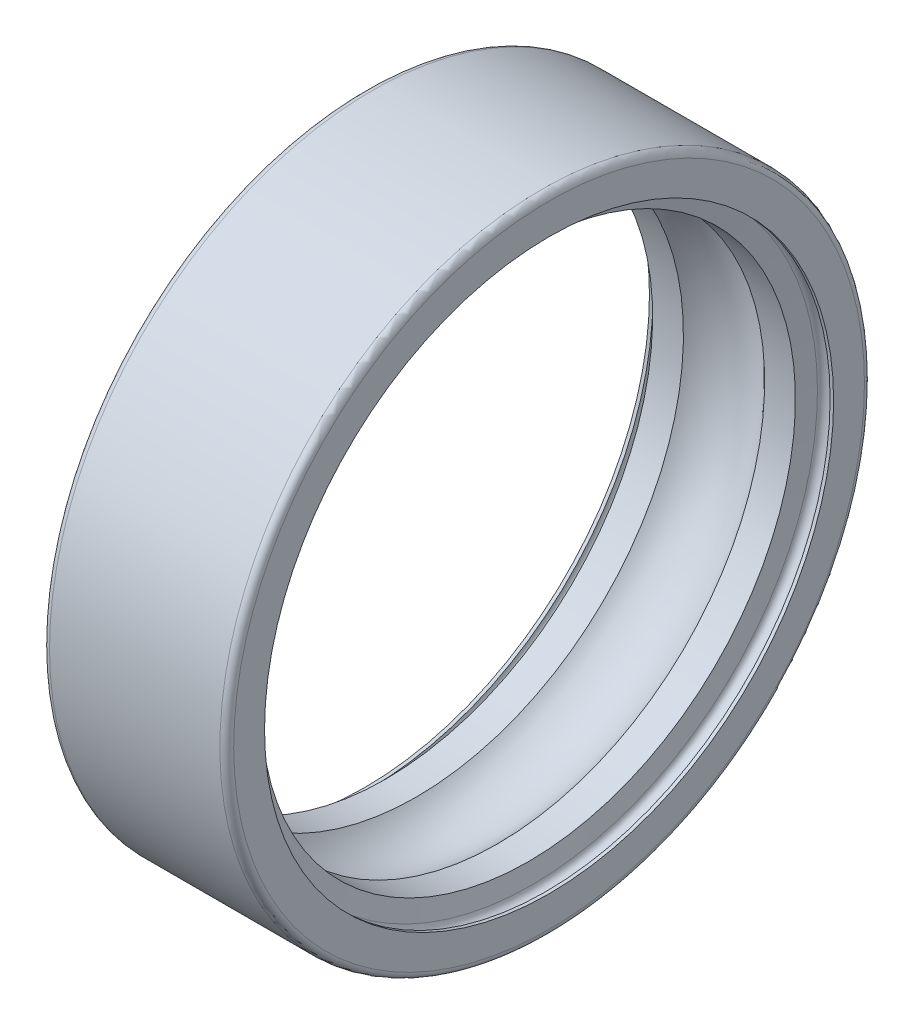
ISO-10303-21;
HEADER;
FILE_DESCRIPTION(('STEP AP214'),'2;1');
FILE_NAME('part.step','',(''),(''),'','','');
FILE_SCHEMA(('AUTOMOTIVE_DESIGN { 1 0 10303 214 1 1 1 1 }'));
ENDSEC;
DATA;
#1=APPLICATION_CONTEXT('core data for automotive mechanical design processes');
#2=APPLICATION_PROTOCOL_DEFINITION('international standard','automotive_design',2000,#1);
#3=PRODUCT_CONTEXT('',#1,'mechanical');
#4=PRODUCT('Part','Part','',(#3));
#5=PRODUCT_RELATED_PRODUCT_CATEGORY('part','',(#4));
#6=PRODUCT_DEFINITION_FORMATION('','',#4);
#7=PRODUCT_DEFINITION_CONTEXT('part definition',#1,'design');
#8=PRODUCT_DEFINITION('design','',#6,#7);
#9=PRODUCT_DEFINITION_SHAPE('','',#8);
#10=(LENGTH_UNIT() NAMED_UNIT(*) SI_UNIT(.MILLI.,.METRE.));
#11=(NAMED_UNIT(*) PLANE_ANGLE_UNIT() SI_UNIT($,.RADIAN.));
#12=(NAMED_UNIT(*) SI_UNIT($,.STERADIAN.) SOLID_ANGLE_UNIT());
#13=UNCERTAINTY_MEASURE_WITH_UNIT(LENGTH_MEASURE(1.E-05),#10,'distance_accuracy_value','');
#14=(GEOMETRIC_REPRESENTATION_CONTEXT(3) GLOBAL_UNCERTAINTY_ASSIGNED_CONTEXT((#13)) GLOBAL_UNIT_ASSIGNED_CONTEXT((#10,
#11,#12)) REPRESENTATION_CONTEXT('',''));
#15=CARTESIAN_POINT('',(0.,0.,0.));
#16=DIRECTION('',(0.,0.,1.));
#17=DIRECTION('',(1.,0.,0.));
#18=AXIS2_PLACEMENT_3D('',#15,#16,#17);
#19=CARTESIAN_POINT('',(8.,13.03,0.));
#20=DIRECTION('',(1.,0.,0.));
#21=DIRECTION('',(0.,1.,0.));
#22=AXIS2_PLACEMENT_3D('',#19,#20,#21);
#23=PLANE('',#22);
#24=CARTESIAN_POINT('',(8.,0.,0.));
#25=DIRECTION('',(1.,0.,0.));
#26=DIRECTION('',(0.,1.,0.));
#27=AXIS2_PLACEMENT_3D('',#24,#25,#26);
#28=CIRCLE('',#27,12.36);
#29=CARTESIAN_POINT('',(8.,-12.36,0.));
#30=VERTEX_POINT('',#29);
#31=EDGE_CURVE('E74',#30,#30,#28,.T.);
#32=ORIENTED_EDGE('',*,*,#31,.F.);
#33=EDGE_LOOP('',(#32));
#34=FACE_BOUND('',#33,.T.);
#35=CARTESIAN_POINT('',(8.,0.,0.));
#36=DIRECTION('',(1.,0.,0.));
#37=DIRECTION('',(0.,1.,0.));
#38=AXIS2_PLACEMENT_3D('',#35,#36,#37);
#39=CIRCLE('',#38,13.7);
#40=CARTESIAN_POINT('',(8.,0.,13.7));
#41=VERTEX_POINT('',#40);
#42=EDGE_CURVE('E123',#41,#41,#39,.T.);
#43=ORIENTED_EDGE('',*,*,#42,.T.);
#44=EDGE_LOOP('',(#43));
#45=FACE_BOUND('',#44,.T.);
#46=ADVANCED_FACE('F15',(#34,#45),#23,.T.);
#47=CARTESIAN_POINT('',(0.,13.03,0.));
#48=DIRECTION('',(-1.,0.,0.));
#49=DIRECTION('',(0.,0.,1.));
#50=AXIS2_PLACEMENT_3D('',#47,#48,#49);
#51=PLANE('',#50);
#52=CARTESIAN_POINT('',(0.,0.,0.));
#53=DIRECTION('',(1.,0.,0.));
#54=DIRECTION('',(0.,1.,0.));
#55=AXIS2_PLACEMENT_3D('',#52,#53,#54);
#56=CIRCLE('',#55,12.36);
#57=CARTESIAN_POINT('',(0.,-12.36,0.));
#58=VERTEX_POINT('',#57);
#59=EDGE_CURVE('E115',#58,#58,#56,.T.);
#60=ORIENTED_EDGE('',*,*,#59,.T.);
#61=EDGE_LOOP('',(#60));
#62=FACE_BOUND('',#61,.T.);
#63=CARTESIAN_POINT('',(0.,0.,0.));
#64=DIRECTION('',(1.,0.,0.));
#65=DIRECTION('',(0.,1.,0.));
#66=AXIS2_PLACEMENT_3D('',#63,#64,#65);
#67=CIRCLE('',#66,13.7);
#68=CARTESIAN_POINT('',(0.,0.,13.7));
#69=VERTEX_POINT('',#68);
#70=EDGE_CURVE('E117',#69,#69,#67,.T.);
#71=ORIENTED_EDGE('',*,*,#70,.F.);
#72=EDGE_LOOP('',(#71));
#73=FACE_BOUND('',#72,.T.);
#74=ADVANCED_FACE('F159',(#62,#73),#51,.T.);
#75=CARTESIAN_POINT('',(7.17296012386629,0.,0.));
#76=DIRECTION('',(1.,0.,0.));
#77=DIRECTION('',(0.,1.,0.));
#78=AXIS2_PLACEMENT_3D('',#75,#76,#77);
#79=CONICAL_SURFACE('',#78,12.0063945230054,1.39626340159546);
#80=CARTESIAN_POINT('',(7.1013018046483,0.,0.));
#81=DIRECTION('',(1.,0.,0.));
#82=DIRECTION('',(0.,1.,0.));
#83=AXIS2_PLACEMENT_3D('',#80,#81,#82);
#84=CIRCLE('',#83,11.6);
#85=CARTESIAN_POINT('',(7.1013018046483,-11.6,0.));
#86=VERTEX_POINT('',#85);
#87=EDGE_CURVE('E10',#86,#86,#84,.T.);
#88=ORIENTED_EDGE('',*,*,#87,.F.);
#89=EDGE_LOOP('',(#88));
#90=FACE_BOUND('',#89,.T.);
#91=CARTESIAN_POINT('',(7.24461844308429,0.,0.));
#92=DIRECTION('',(1.,0.,0.));
#93=DIRECTION('',(0.,1.,0.));
#94=AXIS2_PLACEMENT_3D('',#91,#92,#93);
#95=CIRCLE('',#94,12.4127890460107);
#96=CARTESIAN_POINT('',(7.24461844308429,12.4127890460107,0.));
#97=VERTEX_POINT('',#96);
#98=EDGE_CURVE('E99',#97,#97,#95,.T.);
#99=ORIENTED_EDGE('',*,*,#98,.T.);
#100=EDGE_LOOP('',(#99));
#101=FACE_BOUND('',#100,.T.);
#102=ADVANCED_FACE('F164',(#90,#101),#79,.F.);
#103=CARTESIAN_POINT('',(6.43229156041564,0.,0.));
#104=DIRECTION('',(1.,0.,0.));
#105=DIRECTION('',(0.,1.,0.));
#106=AXIS2_PLACEMENT_3D('',#103,#104,#105);
#107=CYLINDRICAL_SURFACE('',#106,11.6);
#108=CARTESIAN_POINT('',(5.76328131618298,0.,0.));
#109=DIRECTION('',(1.,0.,0.));
#110=DIRECTION('',(0.,1.,0.));
#111=AXIS2_PLACEMENT_3D('',#108,#109,#110);
#112=CIRCLE('',#111,11.6);
#113=CARTESIAN_POINT('',(5.76328131618298,-11.6,0.));
#114=VERTEX_POINT('',#113);
#115=EDGE_CURVE('E65',#114,#114,#112,.T.);
#116=ORIENTED_EDGE('',*,*,#115,.F.);
#117=EDGE_LOOP('',(#116));
#118=FACE_BOUND('',#117,.T.);
#119=ORIENTED_EDGE('',*,*,#87,.T.);
#120=EDGE_LOOP('',(#119));
#121=FACE_BOUND('',#120,.T.);
#122=ADVANCED_FACE('F173',(#118,#121),#107,.F.);
#123=CARTESIAN_POINT('',(1.56770843958436,0.,0.));
#124=DIRECTION('',(1.,0.,0.));
#125=DIRECTION('',(0.,1.,0.));
#126=AXIS2_PLACEMENT_3D('',#123,#124,#125);
#127=CYLINDRICAL_SURFACE('',#126,11.6);
#128=CARTESIAN_POINT('',(0.8986981953517,0.,0.));
#129=DIRECTION('',(1.,0.,0.));
#130=DIRECTION('',(0.,1.,0.));
#131=AXIS2_PLACEMENT_3D('',#128,#129,#130);
#132=CIRCLE('',#131,11.6);
#133=CARTESIAN_POINT('',(0.8986981953517,-11.6,0.));
#134=VERTEX_POINT('',#133);
#135=EDGE_CURVE('E19',#134,#134,#132,.T.);
#136=ORIENTED_EDGE('',*,*,#135,.F.);
#137=EDGE_LOOP('',(#136));
#138=FACE_BOUND('',#137,.T.);
#139=CARTESIAN_POINT('',(2.23671868381701,0.,0.));
#140=DIRECTION('',(1.,0.,0.));
#141=DIRECTION('',(0.,1.,0.));
#142=AXIS2_PLACEMENT_3D('',#139,#140,#141);
#143=CIRCLE('',#142,11.6);
#144=CARTESIAN_POINT('',(2.23671868381701,0.,11.6));
#145=VERTEX_POINT('',#144);
#146=EDGE_CURVE('E113',#145,#145,#143,.T.);
#147=ORIENTED_EDGE('',*,*,#146,.T.);
#148=EDGE_LOOP('',(#147));
#149=FACE_BOUND('',#148,.T.);
#150=ADVANCED_FACE('F144',(#138,#149),#127,.F.);
#151=CARTESIAN_POINT('',(0.827039876133705,0.,0.));
#152=DIRECTION('',(-1.,0.,0.));
#153=DIRECTION('',(0.,1.,0.));
#154=AXIS2_PLACEMENT_3D('',#151,#152,#153);
#155=CONICAL_SURFACE('',#154,12.0063945230054,1.39626340159546);
#156=CARTESIAN_POINT('',(0.755381556915711,0.,0.));
#157=DIRECTION('',(1.,0.,0.));
#158=DIRECTION('',(0.,1.,0.));
#159=AXIS2_PLACEMENT_3D('',#156,#157,#158);
#160=CIRCLE('',#159,12.4127890460107);
#161=CARTESIAN_POINT('',(0.755381556915711,-12.4127890460107,0.));
#162=VERTEX_POINT('',#161);
#163=EDGE_CURVE('E104',#162,#162,#160,.T.);
#164=ORIENTED_EDGE('',*,*,#163,.F.);
#165=EDGE_LOOP('',(#164));
#166=FACE_BOUND('',#165,.T.);
#167=ORIENTED_EDGE('',*,*,#135,.T.);
#168=EDGE_LOOP('',(#167));
#169=FACE_BOUND('',#168,.T.);
#170=ADVANCED_FACE('F178',(#166,#169),#155,.F.);
#171=CARTESIAN_POINT('',(0.076,0.,0.));
#172=DIRECTION('',(1.,0.,0.));
#173=DIRECTION('',(0.,1.,0.));
#174=AXIS2_PLACEMENT_3D('',#171,#172,#173);
#175=CYLINDRICAL_SURFACE('',#174,12.36);
#176=ORIENTED_EDGE('',*,*,#59,.F.);
#177=EDGE_LOOP('',(#176));
#178=FACE_BOUND('',#177,.T.);
#179=CARTESIAN_POINT('',(0.152,0.,0.));
#180=DIRECTION('',(1.,0.,0.));
#181=DIRECTION('',(0.,1.,0.));
#182=AXIS2_PLACEMENT_3D('',#179,#180,#181);
#183=CIRCLE('',#182,12.36);
#184=CARTESIAN_POINT('',(0.152,0.,12.36));
#185=VERTEX_POINT('',#184);
#186=EDGE_CURVE('E98',#185,#185,#183,.T.);
#187=ORIENTED_EDGE('',*,*,#186,.T.);
#188=EDGE_LOOP('',(#187));
#189=FACE_BOUND('',#188,.T.);
#190=ADVANCED_FACE('F180',(#178,#189),#175,.F.);
#191=CARTESIAN_POINT('',(0.3,0.,0.));
#192=DIRECTION('',(1.,0.,0.));
#193=DIRECTION('',(0.,0.,-1.));
#194=AXIS2_PLACEMENT_3D('',#191,#192,#193);
#195=TOROIDAL_SURFACE('',#194,13.7,0.3);
#196=ORIENTED_EDGE('',*,*,#70,.T.);
#197=EDGE_LOOP('',(#196));
#198=FACE_BOUND('',#197,.T.);
#199=CARTESIAN_POINT('',(0.3,0.,0.));
#200=DIRECTION('',(1.,0.,0.));
#201=DIRECTION('',(0.,1.,0.));
#202=AXIS2_PLACEMENT_3D('',#199,#200,#201);
#203=CIRCLE('',#202,14.);
#204=CARTESIAN_POINT('',(0.3,0.,-14.));
#205=VERTEX_POINT('',#204);
#206=EDGE_CURVE('E121',#205,#205,#203,.T.);
#207=ORIENTED_EDGE('',*,*,#206,.F.);
#208=EDGE_LOOP('',(#207));
#209=FACE_BOUND('',#208,.T.);
#210=ADVANCED_FACE('F171',(#198,#209),#195,.T.);
#211=CARTESIAN_POINT('',(4.,0.,0.));
#212=DIRECTION('',(1.,0.,0.));
#213=DIRECTION('',(0.,1.,0.));
#214=AXIS2_PLACEMENT_3D('',#211,#212,#213);
#215=CYLINDRICAL_SURFACE('',#214,14.);
#216=ORIENTED_EDGE('',*,*,#206,.T.);
#217=EDGE_LOOP('',(#216));
#218=FACE_BOUND('',#217,.T.);
#219=CARTESIAN_POINT('',(7.7,0.,0.));
#220=DIRECTION('',(1.,0.,0.));
#221=DIRECTION('',(0.,1.,0.));
#222=AXIS2_PLACEMENT_3D('',#219,#220,#221);
#223=CIRCLE('',#222,14.);
#224=CARTESIAN_POINT('',(7.7,-14.,0.));
#225=VERTEX_POINT('',#224);
#226=EDGE_CURVE('E109',#225,#225,#223,.T.);
#227=ORIENTED_EDGE('',*,*,#226,.F.);
#228=EDGE_LOOP('',(#227));
#229=FACE_BOUND('',#228,.T.);
#230=ADVANCED_FACE('F168',(#218,#229),#215,.T.);
#231=CARTESIAN_POINT('',(7.7,0.,0.));
#232=DIRECTION('',(1.,0.,0.));
#233=DIRECTION('',(0.,0.,-1.));
#234=AXIS2_PLACEMENT_3D('',#231,#232,#233);
#235=TOROIDAL_SURFACE('',#234,13.7,0.3);
#236=ORIENTED_EDGE('',*,*,#226,.T.);
#237=EDGE_LOOP('',(#236));
#238=FACE_BOUND('',#237,.T.);
#239=ORIENTED_EDGE('',*,*,#42,.F.);
#240=EDGE_LOOP('',(#239));
#241=FACE_BOUND('',#240,.T.);
#242=ADVANCED_FACE('F156',(#238,#241),#235,.T.);
#243=CARTESIAN_POINT('',(7.924,0.,0.));
#244=DIRECTION('',(1.,0.,0.));
#245=DIRECTION('',(0.,1.,0.));
#246=AXIS2_PLACEMENT_3D('',#243,#244,#245);
#247=CYLINDRICAL_SURFACE('',#246,12.36);
#248=CARTESIAN_POINT('',(7.848,0.,0.));
#249=DIRECTION('',(1.,0.,0.));
#250=DIRECTION('',(0.,1.,0.));
#251=AXIS2_PLACEMENT_3D('',#248,#249,#250);
#252=CIRCLE('',#251,12.36);
#253=CARTESIAN_POINT('',(7.848,-12.36,0.));
#254=VERTEX_POINT('',#253);
#255=EDGE_CURVE('E93',#254,#254,#252,.T.);
#256=ORIENTED_EDGE('',*,*,#255,.F.);
#257=EDGE_LOOP('',(#256));
#258=FACE_BOUND('',#257,.T.);
#259=ORIENTED_EDGE('',*,*,#31,.T.);
#260=EDGE_LOOP('',(#259));
#261=FACE_BOUND('',#260,.T.);
#262=ADVANCED_FACE('F148',(#258,#261),#247,.F.);
#263=CARTESIAN_POINT('',(4.,0.,0.));
#264=DIRECTION('',(1.,0.,0.));
#265=DIRECTION('',(0.,0.,-1.));
#266=AXIS2_PLACEMENT_3D('',#263,#264,#265);
#267=TOROIDAL_SURFACE('',#266,10.,2.381);
#268=ORIENTED_EDGE('',*,*,#115,.T.);
#269=EDGE_LOOP('',(#268));
#270=FACE_BOUND('',#269,.T.);
#271=ORIENTED_EDGE('',*,*,#146,.F.);
#272=EDGE_LOOP('',(#271));
#273=FACE_BOUND('',#272,.T.);
#274=ADVANCED_FACE('F17',(#270,#273),#267,.F.);
#275=CARTESIAN_POINT('',(0.456,0.,0.));
#276=DIRECTION('',(1.,0.,0.));
#277=DIRECTION('',(0.,0.,-1.));
#278=AXIS2_PLACEMENT_3D('',#275,#276,#277);
#279=TOROIDAL_SURFACE('',#278,12.36,0.304);
#280=ORIENTED_EDGE('',*,*,#163,.T.);
#281=EDGE_LOOP('',(#280));
#282=FACE_BOUND('',#281,.T.);
#283=ORIENTED_EDGE('',*,*,#186,.F.);
#284=EDGE_LOOP('',(#283));
#285=FACE_BOUND('',#284,.T.);
#286=ADVANCED_FACE('F147',(#282,#285),#279,.F.);
#287=CARTESIAN_POINT('',(7.544,0.,0.));
#288=DIRECTION('',(1.,0.,0.));
#289=DIRECTION('',(0.,0.,-1.));
#290=AXIS2_PLACEMENT_3D('',#287,#288,#289);
#291=TOROIDAL_SURFACE('',#290,12.36,0.304);
#292=ORIENTED_EDGE('',*,*,#255,.T.);
#293=EDGE_LOOP('',(#292));
#294=FACE_BOUND('',#293,.T.);
#295=ORIENTED_EDGE('',*,*,#98,.F.);
#296=EDGE_LOOP('',(#295));
#297=FACE_BOUND('',#296,.T.);
#298=ADVANCED_FACE('F94',(#294,#297),#291,.F.);
#299=CLOSED_SHELL('',(#46,#74,#102,#122,#150,#170,#190,#210,#230,#242,#262,#274,#286,#298));
#300=MANIFOLD_SOLID_BREP('B1',#299);
#301=ADVANCED_BREP_SHAPE_REPRESENTATION('',(#18,#300),#14);
#302=SHAPE_DEFINITION_REPRESENTATION(#9,#301);
ENDSEC;
END-ISO-10303-21;
